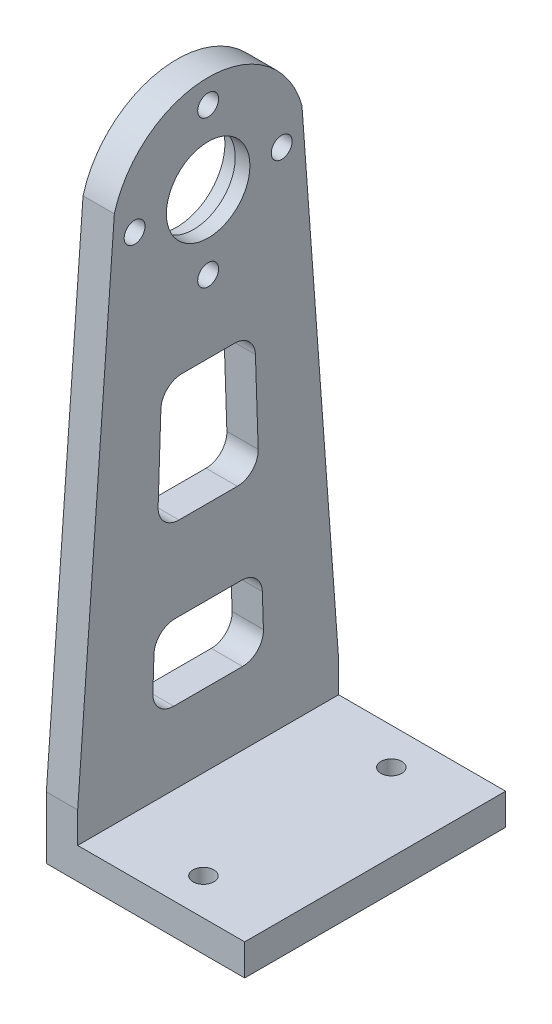
ISO-10303-21;
HEADER;
FILE_DESCRIPTION(('STEP AP214'),'2;1');
FILE_NAME('part.step','',(''),(''),'','','');
FILE_SCHEMA(('AUTOMOTIVE_DESIGN { 1 0 10303 214 1 1 1 1 }'));
ENDSEC;
DATA;
#1=APPLICATION_CONTEXT('core data for automotive mechanical design processes');
#2=APPLICATION_PROTOCOL_DEFINITION('international standard','automotive_design',2000,#1);
#3=PRODUCT_CONTEXT('',#1,'mechanical');
#4=PRODUCT('Part','Part','',(#3));
#5=PRODUCT_RELATED_PRODUCT_CATEGORY('part','',(#4));
#6=PRODUCT_DEFINITION_FORMATION('','',#4);
#7=PRODUCT_DEFINITION_CONTEXT('part definition',#1,'design');
#8=PRODUCT_DEFINITION('design','',#6,#7);
#9=PRODUCT_DEFINITION_SHAPE('','',#8);
#10=(LENGTH_UNIT() NAMED_UNIT(*) SI_UNIT(.MILLI.,.METRE.));
#11=(NAMED_UNIT(*) PLANE_ANGLE_UNIT() SI_UNIT($,.RADIAN.));
#12=(NAMED_UNIT(*) SI_UNIT($,.STERADIAN.) SOLID_ANGLE_UNIT());
#13=UNCERTAINTY_MEASURE_WITH_UNIT(LENGTH_MEASURE(1.E-05),#10,'distance_accuracy_value','');
#14=(GEOMETRIC_REPRESENTATION_CONTEXT(3) GLOBAL_UNCERTAINTY_ASSIGNED_CONTEXT((#13)) GLOBAL_UNIT_ASSIGNED_CONTEXT((#10,
#11,#12)) REPRESENTATION_CONTEXT('',''));
#15=CARTESIAN_POINT('',(0.,0.,0.));
#16=DIRECTION('',(0.,0.,1.));
#17=DIRECTION('',(1.,0.,0.));
#18=AXIS2_PLACEMENT_3D('',#15,#16,#17);
#19=CARTESIAN_POINT('',(15.5,-52.,0.));
#20=DIRECTION('',(-1.,0.,0.));
#21=DIRECTION('',(0.,0.,1.));
#22=AXIS2_PLACEMENT_3D('',#19,#20,#21);
#23=CYLINDRICAL_SURFACE('',#22,4.);
#24=CARTESIAN_POINT('',(16.5,-52.,0.));
#25=DIRECTION('',(-1.,0.,0.));
#26=DIRECTION('',(0.,0.,-1.));
#27=AXIS2_PLACEMENT_3D('',#24,#25,#26);
#28=CIRCLE('',#27,4.);
#29=CARTESIAN_POINT('',(16.5,-52.,-4.));
#30=VERTEX_POINT('',#29);
#31=EDGE_CURVE('E49',#30,#30,#28,.T.);
#32=ORIENTED_EDGE('',*,*,#31,.F.);
#33=EDGE_LOOP('',(#32));
#34=FACE_BOUND('',#33,.T.);
#35=CARTESIAN_POINT('',(15.1,-52.,0.));
#36=DIRECTION('',(-1.,0.,0.));
#37=DIRECTION('',(0.,0.,1.));
#38=AXIS2_PLACEMENT_3D('',#35,#36,#37);
#39=CIRCLE('',#38,4.);
#40=CARTESIAN_POINT('',(15.1,-52.,4.));
#41=VERTEX_POINT('',#40);
#42=EDGE_CURVE('E43',#41,#41,#39,.F.);
#43=ORIENTED_EDGE('',*,*,#42,.F.);
#44=EDGE_LOOP('',(#43));
#45=FACE_BOUND('',#44,.T.);
#46=ADVANCED_FACE('F40',(#34,#45),#23,.F.);
#47=CARTESIAN_POINT('',(16.5,-100.7,-12.5));
#48=DIRECTION('',(1.,0.,0.));
#49=DIRECTION('',(0.,-1.,0.));
#50=AXIS2_PLACEMENT_3D('',#47,#48,#49);
#51=PLANE('',#50);
#52=CARTESIAN_POINT('',(16.5,-59.0452123011725,1.54223501579341E-13));
#53=DIRECTION('',(-1.,0.,0.));
#54=DIRECTION('',(0.,0.,1.));
#55=AXIS2_PLACEMENT_3D('',#52,#53,#54);
#56=CIRCLE('',#55,1.);
#57=CARTESIAN_POINT('',(16.5,-59.0452123011725,1.00000000000015));
#58=VERTEX_POINT('',#57);
#59=EDGE_CURVE('E521',#58,#58,#56,.T.);
#60=ORIENTED_EDGE('',*,*,#59,.T.);
#61=EDGE_LOOP('',(#60));
#62=FACE_BOUND('',#61,.T.);
#63=CARTESIAN_POINT('',(16.5,-52.,7.04521230117253));
#64=DIRECTION('',(-1.,0.,0.));
#65=DIRECTION('',(0.,0.,1.));
#66=AXIS2_PLACEMENT_3D('',#63,#64,#65);
#67=CIRCLE('',#66,1.00000000000001);
#68=CARTESIAN_POINT('',(16.5,-52.,8.04521230117253));
#69=VERTEX_POINT('',#68);
#70=EDGE_CURVE('E527',#69,#69,#67,.T.);
#71=ORIENTED_EDGE('',*,*,#70,.T.);
#72=EDGE_LOOP('',(#71));
#73=FACE_BOUND('',#72,.T.);
#74=CARTESIAN_POINT('',(16.5,-52.0000000000001,-7.04521230117231));
#75=DIRECTION('',(-1.,0.,0.));
#76=DIRECTION('',(0.,0.,1.));
#77=AXIS2_PLACEMENT_3D('',#74,#75,#76);
#78=CIRCLE('',#77,1.);
#79=CARTESIAN_POINT('',(16.5,-52.0000000000001,-6.04521230117231));
#80=VERTEX_POINT('',#79);
#81=EDGE_CURVE('E533',#80,#80,#78,.T.);
#82=ORIENTED_EDGE('',*,*,#81,.T.);
#83=EDGE_LOOP('',(#82));
#84=FACE_BOUND('',#83,.T.);
#85=CARTESIAN_POINT('',(16.5,-44.9547876988277,0.));
#86=DIRECTION('',(-1.,0.,0.));
#87=DIRECTION('',(0.,0.,1.));
#88=AXIS2_PLACEMENT_3D('',#85,#86,#87);
#89=CIRCLE('',#88,1.);
#90=CARTESIAN_POINT('',(16.5,-44.9547876988277,1.00000000000001));
#91=VERTEX_POINT('',#90);
#92=EDGE_CURVE('E199',#91,#91,#89,.T.);
#93=ORIENTED_EDGE('',*,*,#92,.T.);
#94=EDGE_LOOP('',(#93));
#95=FACE_BOUND('',#94,.T.);
#96=DIRECTION('',(0.,-0.997297605701587,-0.0734675823876265));
#97=VECTOR('',#96,1.);
#98=CARTESIAN_POINT('',(16.5,-100.681108800183,-12.7564416540415));
#99=LINE('',#98,#97);
#100=CARTESIAN_POINT('',(16.5,-49.5,-8.986100377806));
#101=VERTEX_POINT('',#100);
#102=CARTESIAN_POINT('',(16.5,-97.2,-12.5));
#103=VERTEX_POINT('',#102);
#104=EDGE_CURVE('E174',#101,#103,#99,.T.);
#105=ORIENTED_EDGE('',*,*,#104,.F.);
#106=CARTESIAN_POINT('',(16.5,-52.0000000000001,0.));
#107=DIRECTION('',(1.,0.,0.));
#108=DIRECTION('',(0.,0.,-1.));
#109=AXIS2_PLACEMENT_3D('',#106,#107,#108);
#110=CIRCLE('',#109,9.32737905308911);
#111=CARTESIAN_POINT('',(16.5,-49.5,8.986100377806));
#112=VERTEX_POINT('',#111);
#113=EDGE_CURVE('E189',#101,#112,#110,.T.);
#114=ORIENTED_EDGE('',*,*,#113,.T.);
#115=DIRECTION('',(0.,0.997297605701587,-0.0734675823876265));
#116=VECTOR('',#115,1.);
#117=CARTESIAN_POINT('',(16.5,-98.8493826998868,12.6215045124945));
#118=LINE('',#117,#116);
#119=CARTESIAN_POINT('',(16.5,-97.2,12.5));
#120=VERTEX_POINT('',#119);
#121=EDGE_CURVE('E194',#120,#112,#118,.T.);
#122=ORIENTED_EDGE('',*,*,#121,.F.);
#123=DIRECTION('',(0.,1.,0.));
#124=VECTOR('',#123,1.);
#125=CARTESIAN_POINT('',(16.5,-100.7,12.5));
#126=LINE('',#125,#124);
#127=CARTESIAN_POINT('',(16.5,-100.149489742783,12.5));
#128=VERTEX_POINT('',#127);
#129=EDGE_CURVE('E154',#128,#120,#126,.T.);
#130=ORIENTED_EDGE('',*,*,#129,.F.);
#131=DIRECTION('',(0.,0.,1.));
#132=VECTOR('',#131,1.);
#133=CARTESIAN_POINT('',(16.5,-100.149489742783,12.5));
#134=LINE('',#133,#132);
#135=CARTESIAN_POINT('',(16.5,-100.149489742783,-12.5));
#136=VERTEX_POINT('',#135);
#137=EDGE_CURVE('E193',#136,#128,#134,.T.);
#138=ORIENTED_EDGE('',*,*,#137,.F.);
#139=DIRECTION('',(0.,1.,0.));
#140=VECTOR('',#139,1.);
#141=CARTESIAN_POINT('',(16.5,-100.7,-12.5));
#142=LINE('',#141,#140);
#143=EDGE_CURVE('E11',#136,#103,#142,.T.);
#144=ORIENTED_EDGE('',*,*,#143,.T.);
#145=EDGE_LOOP('',(#105,#114,#122,#130,#138,#144));
#146=FACE_BOUND('',#145,.T.);
#147=ORIENTED_EDGE('',*,*,#31,.T.);
#148=EDGE_LOOP('',(#147));
#149=FACE_BOUND('',#148,.T.);
#150=CARTESIAN_POINT('',(16.5,-91.2,-3.296767463509));
#151=DIRECTION('',(-1.,0.,0.));
#152=DIRECTION('',(0.,0.0330349000935773,-0.999454198738395));
#153=AXIS2_PLACEMENT_3D('',#150,#151,#152);
#154=CIRCLE('',#153,2.);
#155=CARTESIAN_POINT('',(16.5,-91.13393019981,-5.295675860986));
#156=VERTEX_POINT('',#155);
#157=CARTESIAN_POINT('',(16.5,-93.2,-3.296767463509));
#158=VERTEX_POINT('',#157);
#159=EDGE_CURVE('E261',#156,#158,#154,.T.);
#160=ORIENTED_EDGE('',*,*,#159,.T.);
#161=DIRECTION('',(0.,0.,-1.));
#162=VECTOR('',#161,1.);
#163=CARTESIAN_POINT('',(16.5,-93.2,3.296767463509));
#164=LINE('',#163,#162);
#165=CARTESIAN_POINT('',(16.5,-93.2,3.296767463509));
#166=VERTEX_POINT('',#165);
#167=EDGE_CURVE('E136',#166,#158,#164,.T.);
#168=ORIENTED_EDGE('',*,*,#167,.F.);
#169=CARTESIAN_POINT('',(16.5,-91.2,3.296767463509));
#170=DIRECTION('',(-1.,0.,0.));
#171=DIRECTION('',(0.,-1.,0.));
#172=AXIS2_PLACEMENT_3D('',#169,#170,#171);
#173=CIRCLE('',#172,2.);
#174=CARTESIAN_POINT('',(16.5,-91.13393019981,5.295675860986));
#175=VERTEX_POINT('',#174);
#176=EDGE_CURVE('E267',#166,#175,#173,.T.);
#177=ORIENTED_EDGE('',*,*,#176,.T.);
#178=DIRECTION('',(0.,-0.999454198738395,0.0330349000935798));
#179=VECTOR('',#178,1.);
#180=CARTESIAN_POINT('',(16.5,-87.93393019981,5.189906451609));
#181=LINE('',#180,#179);
#182=CARTESIAN_POINT('',(16.5,-87.93393019981,5.189906451609));
#183=VERTEX_POINT('',#182);
#184=EDGE_CURVE('E147',#183,#175,#181,.T.);
#185=ORIENTED_EDGE('',*,*,#184,.F.);
#186=CARTESIAN_POINT('',(16.5,-88.,3.190998054133));
#187=DIRECTION('',(-1.,0.,0.));
#188=DIRECTION('',(0.,0.0330349000935773,0.999454198738395));
#189=AXIS2_PLACEMENT_3D('',#186,#187,#188);
#190=CIRCLE('',#189,2.);
#191=CARTESIAN_POINT('',(16.5,-86.,3.190998054133));
#192=VERTEX_POINT('',#191);
#193=EDGE_CURVE('E128',#183,#192,#190,.T.);
#194=ORIENTED_EDGE('',*,*,#193,.T.);
#195=DIRECTION('',(0.,0.,1.));
#196=VECTOR('',#195,1.);
#197=CARTESIAN_POINT('',(16.5,-86.,-3.190998054133));
#198=LINE('',#197,#196);
#199=CARTESIAN_POINT('',(16.5,-86.,-3.190998054133));
#200=VERTEX_POINT('',#199);
#201=EDGE_CURVE('E103',#200,#192,#198,.T.);
#202=ORIENTED_EDGE('',*,*,#201,.F.);
#203=CARTESIAN_POINT('',(16.5,-88.,-3.190998054133));
#204=DIRECTION('',(-1.,0.,0.));
#205=DIRECTION('',(0.,1.,0.));
#206=AXIS2_PLACEMENT_3D('',#203,#204,#205);
#207=CIRCLE('',#206,2.);
#208=CARTESIAN_POINT('',(16.5,-87.93393019981,-5.189906451609));
#209=VERTEX_POINT('',#208);
#210=EDGE_CURVE('E122',#200,#209,#207,.T.);
#211=ORIENTED_EDGE('',*,*,#210,.T.);
#212=DIRECTION('',(0.,0.999454198738395,0.0330349000935798));
#213=VECTOR('',#212,1.);
#214=CARTESIAN_POINT('',(16.5,-91.13393019981,-5.295675860986));
#215=LINE('',#214,#213);
#216=EDGE_CURVE('E109',#156,#209,#215,.T.);
#217=ORIENTED_EDGE('',*,*,#216,.F.);
#218=EDGE_LOOP('',(#160,#168,#177,#185,#194,#202,#211,#217));
#219=FACE_BOUND('',#218,.T.);
#220=CARTESIAN_POINT('',(16.5,-68.,-2.529939245529));
#221=DIRECTION('',(-1.,0.,0.));
#222=DIRECTION('',(0.,1.,0.));
#223=AXIS2_PLACEMENT_3D('',#220,#221,#222);
#224=CIRCLE('',#223,2.);
#225=CARTESIAN_POINT('',(16.5,-66.,-2.529939245529));
#226=VERTEX_POINT('',#225);
#227=CARTESIAN_POINT('',(16.5,-67.93393019981,-4.528847643006));
#228=VERTEX_POINT('',#227);
#229=EDGE_CURVE('E241',#226,#228,#224,.T.);
#230=ORIENTED_EDGE('',*,*,#229,.T.);
#231=DIRECTION('',(0.,0.999454198738395,0.0330349000935798));
#232=VECTOR('',#231,1.);
#233=CARTESIAN_POINT('',(16.5,-75.93393019981,-4.793271166447));
#234=LINE('',#233,#232);
#235=CARTESIAN_POINT('',(16.5,-75.93393019981,-4.793271166447));
#236=VERTEX_POINT('',#235);
#237=EDGE_CURVE('E58',#236,#228,#234,.T.);
#238=ORIENTED_EDGE('',*,*,#237,.F.);
#239=CARTESIAN_POINT('',(16.5,-76.,-2.794362768971));
#240=DIRECTION('',(-1.,0.,0.));
#241=DIRECTION('',(0.,0.0330349000935773,-0.999454198738395));
#242=AXIS2_PLACEMENT_3D('',#239,#240,#241);
#243=CIRCLE('',#242,2.);
#244=CARTESIAN_POINT('',(16.5,-78.,-2.794362768971));
#245=VERTEX_POINT('',#244);
#246=EDGE_CURVE('E243',#236,#245,#243,.T.);
#247=ORIENTED_EDGE('',*,*,#246,.T.);
#248=DIRECTION('',(0.,0.,-1.));
#249=VECTOR('',#248,1.);
#250=CARTESIAN_POINT('',(16.5,-78.,2.794362768971));
#251=LINE('',#250,#249);
#252=CARTESIAN_POINT('',(16.5,-78.,2.794362768971));
#253=VERTEX_POINT('',#252);
#254=EDGE_CURVE('E250',#253,#245,#251,.T.);
#255=ORIENTED_EDGE('',*,*,#254,.F.);
#256=CARTESIAN_POINT('',(16.5,-76.,2.794362768971));
#257=DIRECTION('',(-1.,0.,0.));
#258=DIRECTION('',(0.,-1.,0.));
#259=AXIS2_PLACEMENT_3D('',#256,#257,#258);
#260=CIRCLE('',#259,2.);
#261=CARTESIAN_POINT('',(16.5,-75.93393019981,4.793271166447));
#262=VERTEX_POINT('',#261);
#263=EDGE_CURVE('E249',#253,#262,#260,.T.);
#264=ORIENTED_EDGE('',*,*,#263,.T.);
#265=DIRECTION('',(0.,-0.999454198738395,0.0330349000935798));
#266=VECTOR('',#265,1.);
#267=CARTESIAN_POINT('',(16.5,-67.93393019981,4.528847643006));
#268=LINE('',#267,#266);
#269=CARTESIAN_POINT('',(16.5,-67.93393019981,4.528847643006));
#270=VERTEX_POINT('',#269);
#271=EDGE_CURVE('E129',#270,#262,#268,.T.);
#272=ORIENTED_EDGE('',*,*,#271,.F.);
#273=CARTESIAN_POINT('',(16.5,-68.,2.529939245529));
#274=DIRECTION('',(-1.,0.,0.));
#275=DIRECTION('',(0.,0.0330349000935773,0.999454198738395));
#276=AXIS2_PLACEMENT_3D('',#273,#274,#275);
#277=CIRCLE('',#276,2.);
#278=CARTESIAN_POINT('',(16.5,-66.,2.529939245529));
#279=VERTEX_POINT('',#278);
#280=EDGE_CURVE('E256',#270,#279,#277,.T.);
#281=ORIENTED_EDGE('',*,*,#280,.T.);
#282=DIRECTION('',(0.,0.,1.));
#283=VECTOR('',#282,1.);
#284=CARTESIAN_POINT('',(16.5,-66.,-2.529939245529));
#285=LINE('',#284,#283);
#286=EDGE_CURVE('E262',#226,#279,#285,.T.);
#287=ORIENTED_EDGE('',*,*,#286,.F.);
#288=EDGE_LOOP('',(#230,#238,#247,#255,#264,#272,#281,#287));
#289=FACE_BOUND('',#288,.T.);
#290=ADVANCED_FACE('F123',(#62,#73,#84,#95,#146,#149,#219,#289),#51,.T.);
#291=CARTESIAN_POINT('',(15.5,-70.85,12.5));
#292=DIRECTION('',(0.,0.,-1.));
#293=DIRECTION('',(0.,-1.,0.));
#294=AXIS2_PLACEMENT_3D('',#291,#292,#293);
#295=PLANE('',#294);
#296=DIRECTION('',(-1.,0.,0.));
#297=VECTOR('',#296,1.);
#298=CARTESIAN_POINT('',(32.5,-100.149489742783,12.5));
#299=LINE('',#298,#297);
#300=CARTESIAN_POINT('',(32.5,-100.149489742783,12.5));
#301=VERTEX_POINT('',#300);
#302=EDGE_CURVE('E224',#301,#128,#299,.T.);
#303=ORIENTED_EDGE('',*,*,#302,.T.);
#304=ORIENTED_EDGE('',*,*,#129,.T.);
#305=DIRECTION('',(-1.,0.,0.));
#306=VECTOR('',#305,1.);
#307=CARTESIAN_POINT('',(16.5,-97.2,12.5));
#308=LINE('',#307,#306);
#309=CARTESIAN_POINT('',(13.5,-97.2,12.5));
#310=VERTEX_POINT('',#309);
#311=EDGE_CURVE('E160',#120,#310,#308,.T.);
#312=ORIENTED_EDGE('',*,*,#311,.T.);
#313=DIRECTION('',(0.,-1.,0.));
#314=VECTOR('',#313,1.);
#315=CARTESIAN_POINT('',(13.5,0.,12.5));
#316=LINE('',#315,#314);
#317=CARTESIAN_POINT('',(13.5,-103.149489742783,12.5));
#318=VERTEX_POINT('',#317);
#319=EDGE_CURVE('E385',#310,#318,#316,.T.);
#320=ORIENTED_EDGE('',*,*,#319,.T.);
#321=DIRECTION('',(-1.,0.,0.));
#322=VECTOR('',#321,1.);
#323=CARTESIAN_POINT('',(75.6884089130718,-103.149489742783,12.5));
#324=LINE('',#323,#322);
#325=CARTESIAN_POINT('',(32.5,-103.149489742783,12.5));
#326=VERTEX_POINT('',#325);
#327=EDGE_CURVE('E232',#326,#318,#324,.T.);
#328=ORIENTED_EDGE('',*,*,#327,.F.);
#329=DIRECTION('',(0.,-1.,0.));
#330=VECTOR('',#329,1.);
#331=CARTESIAN_POINT('',(32.5,-103.149489742783,12.5));
#332=LINE('',#331,#330);
#333=EDGE_CURVE('E212',#301,#326,#332,.T.);
#334=ORIENTED_EDGE('',*,*,#333,.F.);
#335=EDGE_LOOP('',(#303,#304,#312,#320,#328,#334));
#336=FACE_BOUND('',#335,.T.);
#337=ADVANCED_FACE('F377',(#336),#295,.F.);
#338=CARTESIAN_POINT('',(15.93933982822,-101.76066017178,-12.5));
#339=DIRECTION('',(0.,0.,-1.));
#340=DIRECTION('',(1.,0.,0.));
#341=AXIS2_PLACEMENT_3D('',#338,#339,#340);
#342=PLANE('',#341);
#343=DIRECTION('',(-1.,0.,0.));
#344=VECTOR('',#343,1.);
#345=CARTESIAN_POINT('',(75.6884089130718,-103.149489742783,-12.5));
#346=LINE('',#345,#344);
#347=CARTESIAN_POINT('',(32.5,-103.149489742783,-12.5));
#348=VERTEX_POINT('',#347);
#349=CARTESIAN_POINT('',(13.5,-103.149489742783,-12.5));
#350=VERTEX_POINT('',#349);
#351=EDGE_CURVE('E159',#348,#350,#346,.T.);
#352=ORIENTED_EDGE('',*,*,#351,.T.);
#353=DIRECTION('',(0.,1.,0.));
#354=VECTOR('',#353,1.);
#355=CARTESIAN_POINT('',(13.5,0.,-12.5));
#356=LINE('',#355,#354);
#357=CARTESIAN_POINT('',(13.5,-97.2,-12.5));
#358=VERTEX_POINT('',#357);
#359=EDGE_CURVE('E393',#350,#358,#356,.T.);
#360=ORIENTED_EDGE('',*,*,#359,.T.);
#361=DIRECTION('',(-1.,0.,0.));
#362=VECTOR('',#361,1.);
#363=CARTESIAN_POINT('',(16.5,-97.2,-12.5));
#364=LINE('',#363,#362);
#365=EDGE_CURVE('E163',#103,#358,#364,.T.);
#366=ORIENTED_EDGE('',*,*,#365,.F.);
#367=ORIENTED_EDGE('',*,*,#143,.F.);
#368=DIRECTION('',(-1.,0.,0.));
#369=VECTOR('',#368,1.);
#370=CARTESIAN_POINT('',(32.5,-100.149489742783,-12.5));
#371=LINE('',#370,#369);
#372=CARTESIAN_POINT('',(32.5,-100.149489742783,-12.5));
#373=VERTEX_POINT('',#372);
#374=EDGE_CURVE('E229',#373,#136,#371,.T.);
#375=ORIENTED_EDGE('',*,*,#374,.F.);
#376=DIRECTION('',(0.,1.,0.));
#377=VECTOR('',#376,1.);
#378=CARTESIAN_POINT('',(32.5,-100.149489742783,-12.5));
#379=LINE('',#378,#377);
#380=EDGE_CURVE('E218',#348,#373,#379,.T.);
#381=ORIENTED_EDGE('',*,*,#380,.F.);
#382=EDGE_LOOP('',(#352,#360,#366,#367,#375,#381));
#383=FACE_BOUND('',#382,.T.);
#384=ADVANCED_FACE('F478',(#383),#342,.T.);
#385=CARTESIAN_POINT('',(15.5,-72.,4.663243205897));
#386=DIRECTION('',(0.,0.0330349000935798,0.999454198738395));
#387=DIRECTION('',(0.,0.999454198738395,-0.0330349000935798));
#388=AXIS2_PLACEMENT_3D('',#385,#386,#387);
#389=PLANE('',#388);
#390=ORIENTED_EDGE('',*,*,#271,.T.);
#391=DIRECTION('',(-1.,0.,0.));
#392=VECTOR('',#391,1.);
#393=CARTESIAN_POINT('',(16.5,-75.93393019981,4.793271166447));
#394=LINE('',#393,#392);
#395=CARTESIAN_POINT('',(13.5,-75.93393019981,4.79327116644733));
#396=VERTEX_POINT('',#395);
#397=EDGE_CURVE('E258',#262,#396,#394,.T.);
#398=ORIENTED_EDGE('',*,*,#397,.T.);
#399=DIRECTION('',(0.,0.999454198738395,-0.0330349000935798));
#400=VECTOR('',#399,1.);
#401=CARTESIAN_POINT('',(13.5,0.0753917599162948,2.28093957557516));
#402=LINE('',#401,#400);
#403=CARTESIAN_POINT('',(13.5,-67.93393019981,4.5288476430057));
#404=VERTEX_POINT('',#403);
#405=EDGE_CURVE('E329',#396,#404,#402,.T.);
#406=ORIENTED_EDGE('',*,*,#405,.T.);
#407=DIRECTION('',(-1.,0.,0.));
#408=VECTOR('',#407,1.);
#409=CARTESIAN_POINT('',(16.5,-67.93393019981,4.528847643006));
#410=LINE('',#409,#408);
#411=EDGE_CURVE('E264',#270,#404,#410,.T.);
#412=ORIENTED_EDGE('',*,*,#411,.F.);
#413=EDGE_LOOP('',(#390,#398,#406,#412));
#414=FACE_BOUND('',#413,.T.);
#415=ADVANCED_FACE('F476',(#414),#389,.F.);
#416=CARTESIAN_POINT('',(118.162,-68.,2.529939245529));
#417=DIRECTION('',(-1.,0.,0.));
#418=DIRECTION('',(0.,-0.0330349000935773,-0.999454198738395));
#419=AXIS2_PLACEMENT_3D('',#416,#417,#418);
#420=CYLINDRICAL_SURFACE('',#419,2.);
#421=ORIENTED_EDGE('',*,*,#411,.T.);
#422=CARTESIAN_POINT('',(13.5,-68.,2.529939245529));
#423=DIRECTION('',(1.,0.,0.));
#424=DIRECTION('',(0.,0.,-1.));
#425=AXIS2_PLACEMENT_3D('',#422,#423,#424);
#426=CIRCLE('',#425,2.);
#427=CARTESIAN_POINT('',(13.5,-66.,2.529939245529));
#428=VERTEX_POINT('',#427);
#429=EDGE_CURVE('E208',#404,#428,#426,.F.);
#430=ORIENTED_EDGE('',*,*,#429,.T.);
#431=DIRECTION('',(-1.,0.,0.));
#432=VECTOR('',#431,1.);
#433=CARTESIAN_POINT('',(16.5,-66.,2.529939245529));
#434=LINE('',#433,#432);
#435=EDGE_CURVE('E265',#279,#428,#434,.T.);
#436=ORIENTED_EDGE('',*,*,#435,.F.);
#437=ORIENTED_EDGE('',*,*,#280,.F.);
#438=EDGE_LOOP('',(#421,#430,#436,#437));
#439=FACE_BOUND('',#438,.T.);
#440=ADVANCED_FACE('F340',(#439),#420,.F.);
#441=CARTESIAN_POINT('',(15.5,-66.,0.));
#442=DIRECTION('',(0.,1.,0.));
#443=DIRECTION('',(0.,0.,-1.));
#444=AXIS2_PLACEMENT_3D('',#441,#442,#443);
#445=PLANE('',#444);
#446=ORIENTED_EDGE('',*,*,#286,.T.);
#447=ORIENTED_EDGE('',*,*,#435,.T.);
#448=DIRECTION('',(0.,0.,-1.));
#449=VECTOR('',#448,1.);
#450=CARTESIAN_POINT('',(13.5,-66.,0.));
#451=LINE('',#450,#449);
#452=CARTESIAN_POINT('',(13.5,-66.,-2.529939245529));
#453=VERTEX_POINT('',#452);
#454=EDGE_CURVE('E309',#428,#453,#451,.T.);
#455=ORIENTED_EDGE('',*,*,#454,.T.);
#456=DIRECTION('',(-1.,0.,0.));
#457=VECTOR('',#456,1.);
#458=CARTESIAN_POINT('',(16.5,-66.,-2.529939245529));
#459=LINE('',#458,#457);
#460=EDGE_CURVE('E245',#226,#453,#459,.T.);
#461=ORIENTED_EDGE('',*,*,#460,.F.);
#462=EDGE_LOOP('',(#446,#447,#455,#461));
#463=FACE_BOUND('',#462,.T.);
#464=ADVANCED_FACE('F474',(#463),#445,.F.);
#465=CARTESIAN_POINT('',(118.162,-68.,-2.529939245529));
#466=DIRECTION('',(-1.,0.,0.));
#467=DIRECTION('',(0.,-1.,0.));
#468=AXIS2_PLACEMENT_3D('',#465,#466,#467);
#469=CYLINDRICAL_SURFACE('',#468,2.);
#470=ORIENTED_EDGE('',*,*,#460,.T.);
#471=CARTESIAN_POINT('',(13.5,-68.,-2.529939245529));
#472=DIRECTION('',(1.,0.,0.));
#473=DIRECTION('',(0.,0.,-1.));
#474=AXIS2_PLACEMENT_3D('',#471,#472,#473);
#475=CIRCLE('',#474,2.);
#476=CARTESIAN_POINT('',(13.5,-67.93393019981,-4.52884764300567));
#477=VERTEX_POINT('',#476);
#478=EDGE_CURVE('E312',#453,#477,#475,.F.);
#479=ORIENTED_EDGE('',*,*,#478,.T.);
#480=DIRECTION('',(-1.,0.,0.));
#481=VECTOR('',#480,1.);
#482=CARTESIAN_POINT('',(16.5,-67.93393019981,-4.528847643006));
#483=LINE('',#482,#481);
#484=EDGE_CURVE('E246',#228,#477,#483,.T.);
#485=ORIENTED_EDGE('',*,*,#484,.F.);
#486=ORIENTED_EDGE('',*,*,#229,.F.);
#487=EDGE_LOOP('',(#470,#479,#485,#486));
#488=FACE_BOUND('',#487,.T.);
#489=ADVANCED_FACE('F471',(#488),#469,.F.);
#490=CARTESIAN_POINT('',(15.5,-72.,-4.663243205897));
#491=DIRECTION('',(0.,0.0330349000935798,-0.999454198738395));
#492=DIRECTION('',(0.,-0.999454198738395,-0.0330349000935798));
#493=AXIS2_PLACEMENT_3D('',#490,#491,#492);
#494=PLANE('',#493);
#495=ORIENTED_EDGE('',*,*,#484,.T.);
#496=DIRECTION('',(0.,-0.999454198738395,-0.0330349000935798));
#497=VECTOR('',#496,1.);
#498=CARTESIAN_POINT('',(13.5,0.0753917599162838,-2.28093957557483));
#499=LINE('',#498,#497);
#500=CARTESIAN_POINT('',(13.5,-75.9339301998128,-4.79327116644779));
#501=VERTEX_POINT('',#500);
#502=EDGE_CURVE('E318',#477,#501,#499,.T.);
#503=ORIENTED_EDGE('',*,*,#502,.T.);
#504=DIRECTION('',(-1.,0.,0.));
#505=VECTOR('',#504,1.);
#506=CARTESIAN_POINT('',(16.5,-75.93393019981,-4.793271166447));
#507=LINE('',#506,#505);
#508=EDGE_CURVE('E252',#236,#501,#507,.T.);
#509=ORIENTED_EDGE('',*,*,#508,.F.);
#510=ORIENTED_EDGE('',*,*,#237,.T.);
#511=EDGE_LOOP('',(#495,#503,#509,#510));
#512=FACE_BOUND('',#511,.T.);
#513=ADVANCED_FACE('F467',(#512),#494,.F.);
#514=CARTESIAN_POINT('',(118.162,-76.,-2.794362768971));
#515=DIRECTION('',(-1.,0.,0.));
#516=DIRECTION('',(0.,-0.0330349000935773,0.999454198738395));
#517=AXIS2_PLACEMENT_3D('',#514,#515,#516);
#518=CYLINDRICAL_SURFACE('',#517,2.);
#519=ORIENTED_EDGE('',*,*,#508,.T.);
#520=CARTESIAN_POINT('',(13.5,-76.,-2.794362768971));
#521=DIRECTION('',(1.,0.,0.));
#522=DIRECTION('',(0.,0.,-1.));
#523=AXIS2_PLACEMENT_3D('',#520,#521,#522);
#524=CIRCLE('',#523,2.);
#525=CARTESIAN_POINT('',(13.5,-78.,-2.794362768971));
#526=VERTEX_POINT('',#525);
#527=EDGE_CURVE('E321',#501,#526,#524,.F.);
#528=ORIENTED_EDGE('',*,*,#527,.T.);
#529=DIRECTION('',(-1.,0.,0.));
#530=VECTOR('',#529,1.);
#531=CARTESIAN_POINT('',(16.5,-78.,-2.794362768971));
#532=LINE('',#531,#530);
#533=EDGE_CURVE('E253',#245,#526,#532,.T.);
#534=ORIENTED_EDGE('',*,*,#533,.F.);
#535=ORIENTED_EDGE('',*,*,#246,.F.);
#536=EDGE_LOOP('',(#519,#528,#534,#535));
#537=FACE_BOUND('',#536,.T.);
#538=ADVANCED_FACE('F465',(#537),#518,.F.);
#539=CARTESIAN_POINT('',(15.5,-78.,0.));
#540=DIRECTION('',(0.,-1.,0.));
#541=DIRECTION('',(0.,0.,1.));
#542=AXIS2_PLACEMENT_3D('',#539,#540,#541);
#543=PLANE('',#542);
#544=ORIENTED_EDGE('',*,*,#254,.T.);
#545=ORIENTED_EDGE('',*,*,#533,.T.);
#546=DIRECTION('',(0.,0.,1.));
#547=VECTOR('',#546,1.);
#548=CARTESIAN_POINT('',(13.5,-78.,0.));
#549=LINE('',#548,#547);
#550=CARTESIAN_POINT('',(13.5,-78.,2.794362768971));
#551=VERTEX_POINT('',#550);
#552=EDGE_CURVE('E324',#526,#551,#549,.T.);
#553=ORIENTED_EDGE('',*,*,#552,.T.);
#554=DIRECTION('',(-1.,0.,0.));
#555=VECTOR('',#554,1.);
#556=CARTESIAN_POINT('',(16.5,-78.,2.794362768971));
#557=LINE('',#556,#555);
#558=EDGE_CURVE('E273',#253,#551,#557,.T.);
#559=ORIENTED_EDGE('',*,*,#558,.F.);
#560=EDGE_LOOP('',(#544,#545,#553,#559));
#561=FACE_BOUND('',#560,.T.);
#562=ADVANCED_FACE('F461',(#561),#543,.F.);
#563=CARTESIAN_POINT('',(118.162,-76.,2.794362768971));
#564=DIRECTION('',(-1.,0.,0.));
#565=DIRECTION('',(0.,1.,0.));
#566=AXIS2_PLACEMENT_3D('',#563,#564,#565);
#567=CYLINDRICAL_SURFACE('',#566,2.);
#568=ORIENTED_EDGE('',*,*,#558,.T.);
#569=CARTESIAN_POINT('',(13.5,-76.,2.794362768971));
#570=DIRECTION('',(1.,0.,0.));
#571=DIRECTION('',(0.,0.,-1.));
#572=AXIS2_PLACEMENT_3D('',#569,#570,#571);
#573=CIRCLE('',#572,2.);
#574=EDGE_CURVE('E327',#551,#396,#573,.F.);
#575=ORIENTED_EDGE('',*,*,#574,.T.);
#576=ORIENTED_EDGE('',*,*,#397,.F.);
#577=ORIENTED_EDGE('',*,*,#263,.F.);
#578=EDGE_LOOP('',(#568,#575,#576,#577));
#579=FACE_BOUND('',#578,.T.);
#580=ADVANCED_FACE('F456',(#579),#567,.F.);
#581=CARTESIAN_POINT('',(15.5,-86.,0.));
#582=DIRECTION('',(0.,1.,0.));
#583=DIRECTION('',(0.,0.,-1.));
#584=AXIS2_PLACEMENT_3D('',#581,#582,#583);
#585=PLANE('',#584);
#586=ORIENTED_EDGE('',*,*,#201,.T.);
#587=DIRECTION('',(-1.,0.,0.));
#588=VECTOR('',#587,1.);
#589=CARTESIAN_POINT('',(16.5,-86.,3.190998054133));
#590=LINE('',#589,#588);
#591=CARTESIAN_POINT('',(13.5,-86.,3.190998054133));
#592=VERTEX_POINT('',#591);
#593=EDGE_CURVE('E274',#192,#592,#590,.T.);
#594=ORIENTED_EDGE('',*,*,#593,.T.);
#595=DIRECTION('',(0.,0.,-1.));
#596=VECTOR('',#595,1.);
#597=CARTESIAN_POINT('',(13.5,-86.,0.));
#598=LINE('',#597,#596);
#599=CARTESIAN_POINT('',(13.5,-86.,-3.190998054133));
#600=VERTEX_POINT('',#599);
#601=EDGE_CURVE('E298',#592,#600,#598,.T.);
#602=ORIENTED_EDGE('',*,*,#601,.T.);
#603=DIRECTION('',(-1.,0.,0.));
#604=VECTOR('',#603,1.);
#605=CARTESIAN_POINT('',(16.5,-86.,-3.190998054133));
#606=LINE('',#605,#604);
#607=EDGE_CURVE('E120',#200,#600,#606,.T.);
#608=ORIENTED_EDGE('',*,*,#607,.F.);
#609=EDGE_LOOP('',(#586,#594,#602,#608));
#610=FACE_BOUND('',#609,.T.);
#611=ADVANCED_FACE('F299',(#610),#585,.F.);
#612=CARTESIAN_POINT('',(118.162,-88.,-3.190998054133));
#613=DIRECTION('',(-1.,0.,0.));
#614=DIRECTION('',(0.,-1.,0.));
#615=AXIS2_PLACEMENT_3D('',#612,#613,#614);
#616=CYLINDRICAL_SURFACE('',#615,2.);
#617=ORIENTED_EDGE('',*,*,#607,.T.);
#618=CARTESIAN_POINT('',(13.5,-88.,-3.190998054133));
#619=DIRECTION('',(1.,0.,0.));
#620=DIRECTION('',(0.,0.,-1.));
#621=AXIS2_PLACEMENT_3D('',#618,#619,#620);
#622=CIRCLE('',#621,2.);
#623=CARTESIAN_POINT('',(13.5,-87.93393019981,-5.18990645160947));
#624=VERTEX_POINT('',#623);
#625=EDGE_CURVE('E134',#600,#624,#622,.F.);
#626=ORIENTED_EDGE('',*,*,#625,.T.);
#627=DIRECTION('',(-1.,0.,0.));
#628=VECTOR('',#627,1.);
#629=CARTESIAN_POINT('',(16.5,-87.93393019981,-5.189906451609));
#630=LINE('',#629,#628);
#631=EDGE_CURVE('E114',#209,#624,#630,.T.);
#632=ORIENTED_EDGE('',*,*,#631,.F.);
#633=ORIENTED_EDGE('',*,*,#210,.F.);
#634=EDGE_LOOP('',(#617,#626,#632,#633));
#635=FACE_BOUND('',#634,.T.);
#636=ADVANCED_FACE('F132',(#635),#616,.F.);
#637=CARTESIAN_POINT('',(15.5,-89.6,-5.244974957468));
#638=DIRECTION('',(0.,0.0330349000935798,-0.999454198738395));
#639=DIRECTION('',(0.,-0.999454198738395,-0.0330349000935798));
#640=AXIS2_PLACEMENT_3D('',#637,#638,#639);
#641=PLANE('',#640);
#642=ORIENTED_EDGE('',*,*,#631,.T.);
#643=DIRECTION('',(0.,-0.999454198738395,-0.0330349000935798));
#644=VECTOR('',#643,1.);
#645=CARTESIAN_POINT('',(13.5,0.0753917599162994,-2.2809395755753));
#646=LINE('',#645,#644);
#647=CARTESIAN_POINT('',(13.5,-91.13393019981,-5.295675860986));
#648=VERTEX_POINT('',#647);
#649=EDGE_CURVE('E308',#624,#648,#646,.T.);
#650=ORIENTED_EDGE('',*,*,#649,.T.);
#651=DIRECTION('',(-1.,0.,0.));
#652=VECTOR('',#651,1.);
#653=CARTESIAN_POINT('',(16.5,-91.13393019981,-5.295675860986));
#654=LINE('',#653,#652);
#655=EDGE_CURVE('E117',#156,#648,#654,.T.);
#656=ORIENTED_EDGE('',*,*,#655,.F.);
#657=ORIENTED_EDGE('',*,*,#216,.T.);
#658=EDGE_LOOP('',(#642,#650,#656,#657));
#659=FACE_BOUND('',#658,.T.);
#660=ADVANCED_FACE('F110',(#659),#641,.F.);
#661=CARTESIAN_POINT('',(118.162,-91.2,-3.296767463509));
#662=DIRECTION('',(-1.,0.,0.));
#663=DIRECTION('',(0.,-0.0330349000935773,0.999454198738395));
#664=AXIS2_PLACEMENT_3D('',#661,#662,#663);
#665=CYLINDRICAL_SURFACE('',#664,2.);
#666=ORIENTED_EDGE('',*,*,#655,.T.);
#667=CARTESIAN_POINT('',(13.5,-91.2,-3.296767463509));
#668=DIRECTION('',(1.,0.,0.));
#669=DIRECTION('',(0.,0.,-1.));
#670=AXIS2_PLACEMENT_3D('',#667,#668,#669);
#671=CIRCLE('',#670,2.);
#672=CARTESIAN_POINT('',(13.5,-93.2,-3.296767463509));
#673=VERTEX_POINT('',#672);
#674=EDGE_CURVE('E401',#648,#673,#671,.F.);
#675=ORIENTED_EDGE('',*,*,#674,.T.);
#676=DIRECTION('',(-1.,0.,0.));
#677=VECTOR('',#676,1.);
#678=CARTESIAN_POINT('',(16.5,-93.2,-3.296767463509));
#679=LINE('',#678,#677);
#680=EDGE_CURVE('E141',#158,#673,#679,.T.);
#681=ORIENTED_EDGE('',*,*,#680,.F.);
#682=ORIENTED_EDGE('',*,*,#159,.F.);
#683=EDGE_LOOP('',(#666,#675,#681,#682));
#684=FACE_BOUND('',#683,.T.);
#685=ADVANCED_FACE('F440',(#684),#665,.F.);
#686=CARTESIAN_POINT('',(15.5,-93.2,0.));
#687=DIRECTION('',(0.,-1.,0.));
#688=DIRECTION('',(0.,0.,1.));
#689=AXIS2_PLACEMENT_3D('',#686,#687,#688);
#690=PLANE('',#689);
#691=ORIENTED_EDGE('',*,*,#167,.T.);
#692=ORIENTED_EDGE('',*,*,#680,.T.);
#693=DIRECTION('',(0.,0.,1.));
#694=VECTOR('',#693,1.);
#695=CARTESIAN_POINT('',(13.5,-93.2,0.));
#696=LINE('',#695,#694);
#697=CARTESIAN_POINT('',(13.5,-93.2,3.296767463509));
#698=VERTEX_POINT('',#697);
#699=EDGE_CURVE('E404',#673,#698,#696,.T.);
#700=ORIENTED_EDGE('',*,*,#699,.T.);
#701=DIRECTION('',(-1.,0.,0.));
#702=VECTOR('',#701,1.);
#703=CARTESIAN_POINT('',(16.5,-93.2,3.296767463509));
#704=LINE('',#703,#702);
#705=EDGE_CURVE('E144',#166,#698,#704,.T.);
#706=ORIENTED_EDGE('',*,*,#705,.F.);
#707=EDGE_LOOP('',(#691,#692,#700,#706));
#708=FACE_BOUND('',#707,.T.);
#709=ADVANCED_FACE('F435',(#708),#690,.F.);
#710=CARTESIAN_POINT('',(118.162,-91.2,3.296767463509));
#711=DIRECTION('',(-1.,0.,0.));
#712=DIRECTION('',(0.,1.,0.));
#713=AXIS2_PLACEMENT_3D('',#710,#711,#712);
#714=CYLINDRICAL_SURFACE('',#713,2.);
#715=ORIENTED_EDGE('',*,*,#705,.T.);
#716=CARTESIAN_POINT('',(13.5,-91.2,3.296767463509));
#717=DIRECTION('',(1.,0.,0.));
#718=DIRECTION('',(0.,0.,-1.));
#719=AXIS2_PLACEMENT_3D('',#716,#717,#718);
#720=CIRCLE('',#719,2.);
#721=CARTESIAN_POINT('',(13.5,-91.13393019981,5.29567586098553));
#722=VERTEX_POINT('',#721);
#723=EDGE_CURVE('E407',#698,#722,#720,.F.);
#724=ORIENTED_EDGE('',*,*,#723,.T.);
#725=DIRECTION('',(-1.,0.,0.));
#726=VECTOR('',#725,1.);
#727=CARTESIAN_POINT('',(16.5,-91.13393019981,5.295675860986));
#728=LINE('',#727,#726);
#729=EDGE_CURVE('E148',#175,#722,#728,.T.);
#730=ORIENTED_EDGE('',*,*,#729,.F.);
#731=ORIENTED_EDGE('',*,*,#176,.F.);
#732=EDGE_LOOP('',(#715,#724,#730,#731));
#733=FACE_BOUND('',#732,.T.);
#734=ADVANCED_FACE('F429',(#733),#714,.F.);
#735=CARTESIAN_POINT('',(15.5,-89.6,5.244974957468));
#736=DIRECTION('',(0.,0.0330349000935798,0.999454198738395));
#737=DIRECTION('',(0.,0.999454198738395,-0.0330349000935798));
#738=AXIS2_PLACEMENT_3D('',#735,#736,#737);
#739=PLANE('',#738);
#740=ORIENTED_EDGE('',*,*,#184,.T.);
#741=ORIENTED_EDGE('',*,*,#729,.T.);
#742=DIRECTION('',(0.,0.999454198738395,-0.0330349000935798));
#743=VECTOR('',#742,1.);
#744=CARTESIAN_POINT('',(13.5,0.075391759916284,2.28093957557484));
#745=LINE('',#744,#743);
#746=CARTESIAN_POINT('',(13.5,-87.93393019981,5.1899064516097));
#747=VERTEX_POINT('',#746);
#748=EDGE_CURVE('E410',#722,#747,#745,.T.);
#749=ORIENTED_EDGE('',*,*,#748,.T.);
#750=DIRECTION('',(-1.,0.,0.));
#751=VECTOR('',#750,1.);
#752=CARTESIAN_POINT('',(16.5,-87.93393019981,5.189906451609));
#753=LINE('',#752,#751);
#754=EDGE_CURVE('E151',#183,#747,#753,.T.);
#755=ORIENTED_EDGE('',*,*,#754,.F.);
#756=EDGE_LOOP('',(#740,#741,#749,#755));
#757=FACE_BOUND('',#756,.T.);
#758=ADVANCED_FACE('F423',(#757),#739,.F.);
#759=CARTESIAN_POINT('',(118.162,-88.,3.190998054133));
#760=DIRECTION('',(-1.,0.,0.));
#761=DIRECTION('',(0.,-0.0330349000935773,-0.999454198738395));
#762=AXIS2_PLACEMENT_3D('',#759,#760,#761);
#763=CYLINDRICAL_SURFACE('',#762,2.);
#764=ORIENTED_EDGE('',*,*,#754,.T.);
#765=CARTESIAN_POINT('',(13.5,-88.,3.190998054133));
#766=DIRECTION('',(1.,0.,0.));
#767=DIRECTION('',(0.,0.,-1.));
#768=AXIS2_PLACEMENT_3D('',#765,#766,#767);
#769=CIRCLE('',#768,2.);
#770=EDGE_CURVE('E303',#747,#592,#769,.F.);
#771=ORIENTED_EDGE('',*,*,#770,.T.);
#772=ORIENTED_EDGE('',*,*,#593,.F.);
#773=ORIENTED_EDGE('',*,*,#193,.F.);
#774=EDGE_LOOP('',(#764,#771,#772,#773));
#775=FACE_BOUND('',#774,.T.);
#776=ADVANCED_FACE('F413',(#775),#763,.F.);
#777=CARTESIAN_POINT('',(75.6884089130718,-103.149489742783,-12.5));
#778=DIRECTION('',(0.,-1.,0.));
#779=DIRECTION('',(0.,0.,-1.));
#780=AXIS2_PLACEMENT_3D('',#777,#778,#779);
#781=PLANE('',#780);
#782=CARTESIAN_POINT('',(25.0500000000012,-103.149489742783,-8.99999999999979));
#783=DIRECTION('',(0.,-1.,0.));
#784=DIRECTION('',(0.,0.,-1.));
#785=AXIS2_PLACEMENT_3D('',#782,#783,#784);
#786=CIRCLE('',#785,0.999999999998714);
#787=CARTESIAN_POINT('',(25.0500000000012,-103.149489742783,-9.99999999999851));
#788=VERTEX_POINT('',#787);
#789=EDGE_CURVE('E501',#788,#788,#786,.T.);
#790=ORIENTED_EDGE('',*,*,#789,.F.);
#791=EDGE_LOOP('',(#790));
#792=FACE_BOUND('',#791,.T.);
#793=CARTESIAN_POINT('',(25.0500000000011,-103.149489742783,9.00000000000017));
#794=DIRECTION('',(0.,-1.,0.));
#795=DIRECTION('',(0.,0.,-1.));
#796=AXIS2_PLACEMENT_3D('',#793,#794,#795);
#797=CIRCLE('',#796,0.99999999999868);
#798=CARTESIAN_POINT('',(25.0500000000011,-103.149489742783,8.00000000000149));
#799=VERTEX_POINT('',#798);
#800=EDGE_CURVE('E516',#799,#799,#797,.T.);
#801=ORIENTED_EDGE('',*,*,#800,.F.);
#802=EDGE_LOOP('',(#801));
#803=FACE_BOUND('',#802,.T.);
#804=ORIENTED_EDGE('',*,*,#351,.F.);
#805=DIRECTION('',(0.,0.,-1.));
#806=VECTOR('',#805,1.);
#807=CARTESIAN_POINT('',(32.5,-103.149489742783,-12.5));
#808=LINE('',#807,#806);
#809=EDGE_CURVE('E215',#326,#348,#808,.T.);
#810=ORIENTED_EDGE('',*,*,#809,.F.);
#811=ORIENTED_EDGE('',*,*,#327,.T.);
#812=DIRECTION('',(0.,0.,-1.));
#813=VECTOR('',#812,1.);
#814=CARTESIAN_POINT('',(13.5,-103.149489742783,-12.5));
#815=LINE('',#814,#813);
#816=EDGE_CURVE('E392',#318,#350,#815,.T.);
#817=ORIENTED_EDGE('',*,*,#816,.T.);
#818=EDGE_LOOP('',(#804,#810,#811,#817));
#819=FACE_BOUND('',#818,.T.);
#820=ADVANCED_FACE('F568',(#792,#803,#819),#781,.T.);
#821=CARTESIAN_POINT('',(32.5,-100.149489742783,12.5));
#822=DIRECTION('',(0.,-1.,0.));
#823=DIRECTION('',(0.,0.,-1.));
#824=AXIS2_PLACEMENT_3D('',#821,#822,#823);
#825=PLANE('',#824);
#826=CARTESIAN_POINT('',(25.0500000000012,-100.149489742783,-8.99999999999979));
#827=DIRECTION('',(0.,1.,0.));
#828=DIRECTION('',(0.,0.,1.));
#829=AXIS2_PLACEMENT_3D('',#826,#827,#828);
#830=CIRCLE('',#829,0.999999999998714);
#831=CARTESIAN_POINT('',(25.0500000000012,-100.149489742783,-8.00000000000108));
#832=VERTEX_POINT('',#831);
#833=EDGE_CURVE('E498',#832,#832,#830,.T.);
#834=ORIENTED_EDGE('',*,*,#833,.F.);
#835=EDGE_LOOP('',(#834));
#836=FACE_BOUND('',#835,.T.);
#837=CARTESIAN_POINT('',(25.0500000000011,-100.149489742783,9.00000000000017));
#838=DIRECTION('',(0.,1.,0.));
#839=DIRECTION('',(0.,0.,1.));
#840=AXIS2_PLACEMENT_3D('',#837,#838,#839);
#841=CIRCLE('',#840,0.99999999999868);
#842=CARTESIAN_POINT('',(25.0500000000011,-100.149489742783,9.99999999999885));
#843=VERTEX_POINT('',#842);
#844=EDGE_CURVE('E513',#843,#843,#841,.T.);
#845=ORIENTED_EDGE('',*,*,#844,.F.);
#846=EDGE_LOOP('',(#845));
#847=FACE_BOUND('',#846,.T.);
#848=ORIENTED_EDGE('',*,*,#137,.T.);
#849=ORIENTED_EDGE('',*,*,#302,.F.);
#850=DIRECTION('',(0.,0.,1.));
#851=VECTOR('',#850,1.);
#852=CARTESIAN_POINT('',(32.5,-100.149489742783,12.5));
#853=LINE('',#852,#851);
#854=EDGE_CURVE('E221',#373,#301,#853,.T.);
#855=ORIENTED_EDGE('',*,*,#854,.F.);
#856=ORIENTED_EDGE('',*,*,#374,.T.);
#857=EDGE_LOOP('',(#848,#849,#855,#856));
#858=FACE_BOUND('',#857,.T.);
#859=ADVANCED_FACE('F371',(#836,#847,#858),#825,.F.);
#860=CARTESIAN_POINT('',(32.5,0.,0.));
#861=DIRECTION('',(-1.,0.,0.));
#862=DIRECTION('',(0.,0.,1.));
#863=AXIS2_PLACEMENT_3D('',#860,#861,#862);
#864=PLANE('',#863);
#865=ORIENTED_EDGE('',*,*,#333,.T.);
#866=ORIENTED_EDGE('',*,*,#809,.T.);
#867=ORIENTED_EDGE('',*,*,#380,.T.);
#868=ORIENTED_EDGE('',*,*,#854,.T.);
#869=EDGE_LOOP('',(#865,#866,#867,#868));
#870=FACE_BOUND('',#869,.T.);
#871=ADVANCED_FACE('F562',(#870),#864,.F.);
#872=CARTESIAN_POINT('',(22.,-49.5,-8.986100377806));
#873=DIRECTION('',(0.,-0.0734675823876265,0.997297605701587));
#874=DIRECTION('',(0.,-0.997297605701587,-0.0734675823876265));
#875=AXIS2_PLACEMENT_3D('',#872,#873,#874);
#876=PLANE('',#875);
#877=ORIENTED_EDGE('',*,*,#104,.T.);
#878=ORIENTED_EDGE('',*,*,#365,.T.);
#879=DIRECTION('',(0.,0.997297605701587,0.0734675823876265));
#880=VECTOR('',#879,1.);
#881=CARTESIAN_POINT('',(13.5,0.391227443813302,-5.31078035127329));
#882=LINE('',#881,#880);
#883=CARTESIAN_POINT('',(13.5,-49.5,-8.986100377806));
#884=VERTEX_POINT('',#883);
#885=EDGE_CURVE('E177',#358,#884,#882,.T.);
#886=ORIENTED_EDGE('',*,*,#885,.T.);
#887=DIRECTION('',(1.,0.,0.));
#888=VECTOR('',#887,1.);
#889=CARTESIAN_POINT('',(14.5,-49.5,-8.986100377806));
#890=LINE('',#889,#888);
#891=EDGE_CURVE('E158',#884,#101,#890,.T.);
#892=ORIENTED_EDGE('',*,*,#891,.T.);
#893=EDGE_LOOP('',(#877,#878,#886,#892));
#894=FACE_BOUND('',#893,.T.);
#895=ADVANCED_FACE('F172',(#894),#876,.F.);
#896=CARTESIAN_POINT('',(22.,-49.5,8.986100377806));
#897=DIRECTION('',(0.,-0.0734675823876265,-0.997297605701587));
#898=DIRECTION('',(0.,0.997297605701587,-0.0734675823876265));
#899=AXIS2_PLACEMENT_3D('',#896,#897,#898);
#900=PLANE('',#899);
#901=ORIENTED_EDGE('',*,*,#121,.T.);
#902=DIRECTION('',(1.,0.,0.));
#903=VECTOR('',#902,1.);
#904=CARTESIAN_POINT('',(14.5,-49.5,8.986100377806));
#905=LINE('',#904,#903);
#906=CARTESIAN_POINT('',(13.5,-49.5,8.986100377806));
#907=VERTEX_POINT('',#906);
#908=EDGE_CURVE('E155',#907,#112,#905,.T.);
#909=ORIENTED_EDGE('',*,*,#908,.F.);
#910=DIRECTION('',(0.,-0.997297605701587,0.0734675823876265));
#911=VECTOR('',#910,1.);
#912=CARTESIAN_POINT('',(13.5,0.391227443813302,5.31078035127329));
#913=LINE('',#912,#911);
#914=EDGE_CURVE('E201',#907,#310,#913,.T.);
#915=ORIENTED_EDGE('',*,*,#914,.T.);
#916=ORIENTED_EDGE('',*,*,#311,.F.);
#917=EDGE_LOOP('',(#901,#909,#915,#916));
#918=FACE_BOUND('',#917,.T.);
#919=ADVANCED_FACE('F379',(#918),#900,.F.);
#920=CARTESIAN_POINT('',(13.5,-52.0000000000001,0.));
#921=DIRECTION('',(1.,0.,0.));
#922=DIRECTION('',(0.,0.,-1.));
#923=AXIS2_PLACEMENT_3D('',#920,#921,#922);
#924=CYLINDRICAL_SURFACE('',#923,9.32737905308911);
#925=ORIENTED_EDGE('',*,*,#113,.F.);
#926=ORIENTED_EDGE('',*,*,#891,.F.);
#927=CARTESIAN_POINT('',(13.5,-52.0000000000001,0.));
#928=DIRECTION('',(1.,0.,0.));
#929=DIRECTION('',(0.,0.,-1.));
#930=AXIS2_PLACEMENT_3D('',#927,#928,#929);
#931=CIRCLE('',#930,9.32737905308911);
#932=EDGE_CURVE('E198',#884,#907,#931,.T.);
#933=ORIENTED_EDGE('',*,*,#932,.T.);
#934=ORIENTED_EDGE('',*,*,#908,.T.);
#935=EDGE_LOOP('',(#925,#926,#933,#934));
#936=FACE_BOUND('',#935,.T.);
#937=ADVANCED_FACE('F196',(#936),#924,.T.);
#938=CARTESIAN_POINT('',(13.5,0.,0.));
#939=DIRECTION('',(1.,0.,0.));
#940=DIRECTION('',(0.,0.,-1.));
#941=AXIS2_PLACEMENT_3D('',#938,#939,#940);
#942=PLANE('',#941);
#943=CARTESIAN_POINT('',(13.5,-52.0000000000001,0.));
#944=DIRECTION('',(-1.,0.,0.));
#945=DIRECTION('',(0.,0.,1.));
#946=AXIS2_PLACEMENT_3D('',#943,#944,#945);
#947=CIRCLE('',#946,4.6);
#948=CARTESIAN_POINT('',(13.5,-52.0000000000001,4.6));
#949=VERTEX_POINT('',#948);
#950=EDGE_CURVE('E504',#949,#949,#947,.T.);
#951=ORIENTED_EDGE('',*,*,#950,.F.);
#952=EDGE_LOOP('',(#951));
#953=FACE_BOUND('',#952,.T.);
#954=CARTESIAN_POINT('',(13.5,-59.0452123011725,1.54223501579341E-13));
#955=DIRECTION('',(-1.,0.,0.));
#956=DIRECTION('',(0.,0.,1.));
#957=AXIS2_PLACEMENT_3D('',#954,#955,#956);
#958=CIRCLE('',#957,1.);
#959=CARTESIAN_POINT('',(13.5,-59.0452123011725,1.00000000000015));
#960=VERTEX_POINT('',#959);
#961=EDGE_CURVE('E520',#960,#960,#958,.T.);
#962=ORIENTED_EDGE('',*,*,#961,.F.);
#963=EDGE_LOOP('',(#962));
#964=FACE_BOUND('',#963,.T.);
#965=CARTESIAN_POINT('',(13.5,-52.,7.04521230117253));
#966=DIRECTION('',(-1.,0.,0.));
#967=DIRECTION('',(0.,0.,1.));
#968=AXIS2_PLACEMENT_3D('',#965,#966,#967);
#969=CIRCLE('',#968,1.00000000000001);
#970=CARTESIAN_POINT('',(13.5,-52.,8.04521230117253));
#971=VERTEX_POINT('',#970);
#972=EDGE_CURVE('E524',#971,#971,#969,.T.);
#973=ORIENTED_EDGE('',*,*,#972,.F.);
#974=EDGE_LOOP('',(#973));
#975=FACE_BOUND('',#974,.T.);
#976=CARTESIAN_POINT('',(13.5,-52.0000000000001,-7.04521230117231));
#977=DIRECTION('',(-1.,0.,0.));
#978=DIRECTION('',(0.,0.,1.));
#979=AXIS2_PLACEMENT_3D('',#976,#977,#978);
#980=CIRCLE('',#979,1.);
#981=CARTESIAN_POINT('',(13.5,-52.0000000000001,-6.04521230117231));
#982=VERTEX_POINT('',#981);
#983=EDGE_CURVE('E530',#982,#982,#980,.T.);
#984=ORIENTED_EDGE('',*,*,#983,.F.);
#985=EDGE_LOOP('',(#984));
#986=FACE_BOUND('',#985,.T.);
#987=CARTESIAN_POINT('',(13.5,-44.9547876988277,0.));
#988=DIRECTION('',(-1.,0.,0.));
#989=DIRECTION('',(0.,0.,1.));
#990=AXIS2_PLACEMENT_3D('',#987,#988,#989);
#991=CIRCLE('',#990,1.);
#992=CARTESIAN_POINT('',(13.5,-44.9547876988277,1.00000000000001));
#993=VERTEX_POINT('',#992);
#994=EDGE_CURVE('E204',#993,#993,#991,.T.);
#995=ORIENTED_EDGE('',*,*,#994,.F.);
#996=EDGE_LOOP('',(#995));
#997=FACE_BOUND('',#996,.T.);
#998=ORIENTED_EDGE('',*,*,#932,.F.);
#999=ORIENTED_EDGE('',*,*,#885,.F.);
#1000=ORIENTED_EDGE('',*,*,#359,.F.);
#1001=ORIENTED_EDGE('',*,*,#816,.F.);
#1002=ORIENTED_EDGE('',*,*,#319,.F.);
#1003=ORIENTED_EDGE('',*,*,#914,.F.);
#1004=EDGE_LOOP('',(#998,#999,#1000,#1001,#1002,#1003));
#1005=FACE_BOUND('',#1004,.T.);
#1006=ORIENTED_EDGE('',*,*,#649,.F.);
#1007=ORIENTED_EDGE('',*,*,#625,.F.);
#1008=ORIENTED_EDGE('',*,*,#601,.F.);
#1009=ORIENTED_EDGE('',*,*,#770,.F.);
#1010=ORIENTED_EDGE('',*,*,#748,.F.);
#1011=ORIENTED_EDGE('',*,*,#723,.F.);
#1012=ORIENTED_EDGE('',*,*,#699,.F.);
#1013=ORIENTED_EDGE('',*,*,#674,.F.);
#1014=EDGE_LOOP('',(#1006,#1007,#1008,#1009,#1010,#1011,#1012,#1013));
#1015=FACE_BOUND('',#1014,.T.);
#1016=ORIENTED_EDGE('',*,*,#454,.F.);
#1017=ORIENTED_EDGE('',*,*,#429,.F.);
#1018=ORIENTED_EDGE('',*,*,#405,.F.);
#1019=ORIENTED_EDGE('',*,*,#574,.F.);
#1020=ORIENTED_EDGE('',*,*,#552,.F.);
#1021=ORIENTED_EDGE('',*,*,#527,.F.);
#1022=ORIENTED_EDGE('',*,*,#502,.F.);
#1023=ORIENTED_EDGE('',*,*,#478,.F.);
#1024=EDGE_LOOP('',(#1016,#1017,#1018,#1019,#1020,#1021,#1022,#1023));
#1025=FACE_BOUND('',#1024,.T.);
#1026=ADVANCED_FACE('F305',(#953,#964,#975,#986,#997,#1005,#1015,#1025),#942,.F.);
#1027=CARTESIAN_POINT('',(16.5,-44.9547876988277,0.));
#1028=DIRECTION('',(-1.,0.,0.));
#1029=DIRECTION('',(0.,0.,1.));
#1030=AXIS2_PLACEMENT_3D('',#1027,#1028,#1029);
#1031=CYLINDRICAL_SURFACE('',#1030,1.);
#1032=ORIENTED_EDGE('',*,*,#92,.F.);
#1033=EDGE_LOOP('',(#1032));
#1034=FACE_BOUND('',#1033,.T.);
#1035=ORIENTED_EDGE('',*,*,#994,.T.);
#1036=EDGE_LOOP('',(#1035));
#1037=FACE_BOUND('',#1036,.T.);
#1038=ADVANCED_FACE('F541',(#1034,#1037),#1031,.F.);
#1039=CARTESIAN_POINT('',(16.5,-52.0000000000001,-7.04521230117231));
#1040=DIRECTION('',(-1.,0.,0.));
#1041=DIRECTION('',(0.,0.,1.));
#1042=AXIS2_PLACEMENT_3D('',#1039,#1040,#1041);
#1043=CYLINDRICAL_SURFACE('',#1042,1.);
#1044=ORIENTED_EDGE('',*,*,#81,.F.);
#1045=EDGE_LOOP('',(#1044));
#1046=FACE_BOUND('',#1045,.T.);
#1047=ORIENTED_EDGE('',*,*,#983,.T.);
#1048=EDGE_LOOP('',(#1047));
#1049=FACE_BOUND('',#1048,.T.);
#1050=ADVANCED_FACE('F550',(#1046,#1049),#1043,.F.);
#1051=CARTESIAN_POINT('',(16.5,-52.,7.04521230117253));
#1052=DIRECTION('',(-1.,0.,0.));
#1053=DIRECTION('',(0.,0.,1.));
#1054=AXIS2_PLACEMENT_3D('',#1051,#1052,#1053);
#1055=CYLINDRICAL_SURFACE('',#1054,1.00000000000001);
#1056=ORIENTED_EDGE('',*,*,#70,.F.);
#1057=EDGE_LOOP('',(#1056));
#1058=FACE_BOUND('',#1057,.T.);
#1059=ORIENTED_EDGE('',*,*,#972,.T.);
#1060=EDGE_LOOP('',(#1059));
#1061=FACE_BOUND('',#1060,.T.);
#1062=ADVANCED_FACE('F602',(#1058,#1061),#1055,.F.);
#1063=CARTESIAN_POINT('',(16.5,-59.0452123011725,1.54223501579341E-13));
#1064=DIRECTION('',(-1.,0.,0.));
#1065=DIRECTION('',(0.,0.,1.));
#1066=AXIS2_PLACEMENT_3D('',#1063,#1064,#1065);
#1067=CYLINDRICAL_SURFACE('',#1066,1.);
#1068=ORIENTED_EDGE('',*,*,#59,.F.);
#1069=EDGE_LOOP('',(#1068));
#1070=FACE_BOUND('',#1069,.T.);
#1071=ORIENTED_EDGE('',*,*,#961,.T.);
#1072=EDGE_LOOP('',(#1071));
#1073=FACE_BOUND('',#1072,.T.);
#1074=ADVANCED_FACE('F591',(#1070,#1073),#1067,.F.);
#1075=CARTESIAN_POINT('',(25.0500000000011,-111.649489742783,9.00000000000017));
#1076=DIRECTION('',(0.,1.,0.));
#1077=DIRECTION('',(0.,0.,1.));
#1078=AXIS2_PLACEMENT_3D('',#1075,#1076,#1077);
#1079=CYLINDRICAL_SURFACE('',#1078,0.99999999999868);
#1080=ORIENTED_EDGE('',*,*,#800,.T.);
#1081=EDGE_LOOP('',(#1080));
#1082=FACE_BOUND('',#1081,.T.);
#1083=ORIENTED_EDGE('',*,*,#844,.T.);
#1084=EDGE_LOOP('',(#1083));
#1085=FACE_BOUND('',#1084,.T.);
#1086=ADVANCED_FACE('F587',(#1082,#1085),#1079,.F.);
#1087=CARTESIAN_POINT('',(25.0500000000012,-111.649489742783,-8.99999999999979));
#1088=DIRECTION('',(0.,1.,0.));
#1089=DIRECTION('',(0.,0.,1.));
#1090=AXIS2_PLACEMENT_3D('',#1087,#1088,#1089);
#1091=CYLINDRICAL_SURFACE('',#1090,0.999999999998714);
#1092=ORIENTED_EDGE('',*,*,#789,.T.);
#1093=EDGE_LOOP('',(#1092));
#1094=FACE_BOUND('',#1093,.T.);
#1095=ORIENTED_EDGE('',*,*,#833,.T.);
#1096=EDGE_LOOP('',(#1095));
#1097=FACE_BOUND('',#1096,.T.);
#1098=ADVANCED_FACE('F590',(#1094,#1097),#1091,.F.);
#1099=CARTESIAN_POINT('',(15.1,-52.0000000000001,0.));
#1100=DIRECTION('',(-1.,0.,0.));
#1101=DIRECTION('',(0.,0.,1.));
#1102=AXIS2_PLACEMENT_3D('',#1099,#1100,#1101);
#1103=PLANE('',#1102);
#1104=CARTESIAN_POINT('',(15.1,-52.0000000000001,0.));
#1105=DIRECTION('',(-1.,0.,0.));
#1106=DIRECTION('',(0.,0.,1.));
#1107=AXIS2_PLACEMENT_3D('',#1104,#1105,#1106);
#1108=CIRCLE('',#1107,4.6);
#1109=CARTESIAN_POINT('',(15.1,-52.0000000000001,4.6));
#1110=VERTEX_POINT('',#1109);
#1111=EDGE_CURVE('E499',#1110,#1110,#1108,.T.);
#1112=ORIENTED_EDGE('',*,*,#1111,.T.);
#1113=EDGE_LOOP('',(#1112));
#1114=FACE_BOUND('',#1113,.T.);
#1115=ORIENTED_EDGE('',*,*,#42,.T.);
#1116=EDGE_LOOP('',(#1115));
#1117=FACE_BOUND('',#1116,.T.);
#1118=ADVANCED_FACE('F599',(#1114,#1117),#1103,.T.);
#1119=CARTESIAN_POINT('',(15.1,-52.0000000000001,0.));
#1120=DIRECTION('',(-1.,0.,0.));
#1121=DIRECTION('',(0.,0.,1.));
#1122=AXIS2_PLACEMENT_3D('',#1119,#1120,#1121);
#1123=CYLINDRICAL_SURFACE('',#1122,4.6);
#1124=ORIENTED_EDGE('',*,*,#1111,.F.);
#1125=EDGE_LOOP('',(#1124));
#1126=FACE_BOUND('',#1125,.T.);
#1127=ORIENTED_EDGE('',*,*,#950,.T.);
#1128=EDGE_LOOP('',(#1127));
#1129=FACE_BOUND('',#1128,.T.);
#1130=ADVANCED_FACE('F688',(#1126,#1129),#1123,.F.);
#1131=CLOSED_SHELL('',(#46,#290,#337,#384,#415,#440,#464,#489,#513,#538,#562,#580,#611,#636,
#660,#685,#709,#734,#758,#776,#820,#859,#871,#895,#919,#937,#1026,#1038,#1050,#1062,#1074,#1086,
#1098,#1118,#1130));
#1132=MANIFOLD_SOLID_BREP('B2',#1131);
#1133=ADVANCED_BREP_SHAPE_REPRESENTATION('',(#18,#1132),#14);
#1134=SHAPE_DEFINITION_REPRESENTATION(#9,#1133);
ENDSEC;
END-ISO-10303-21;
